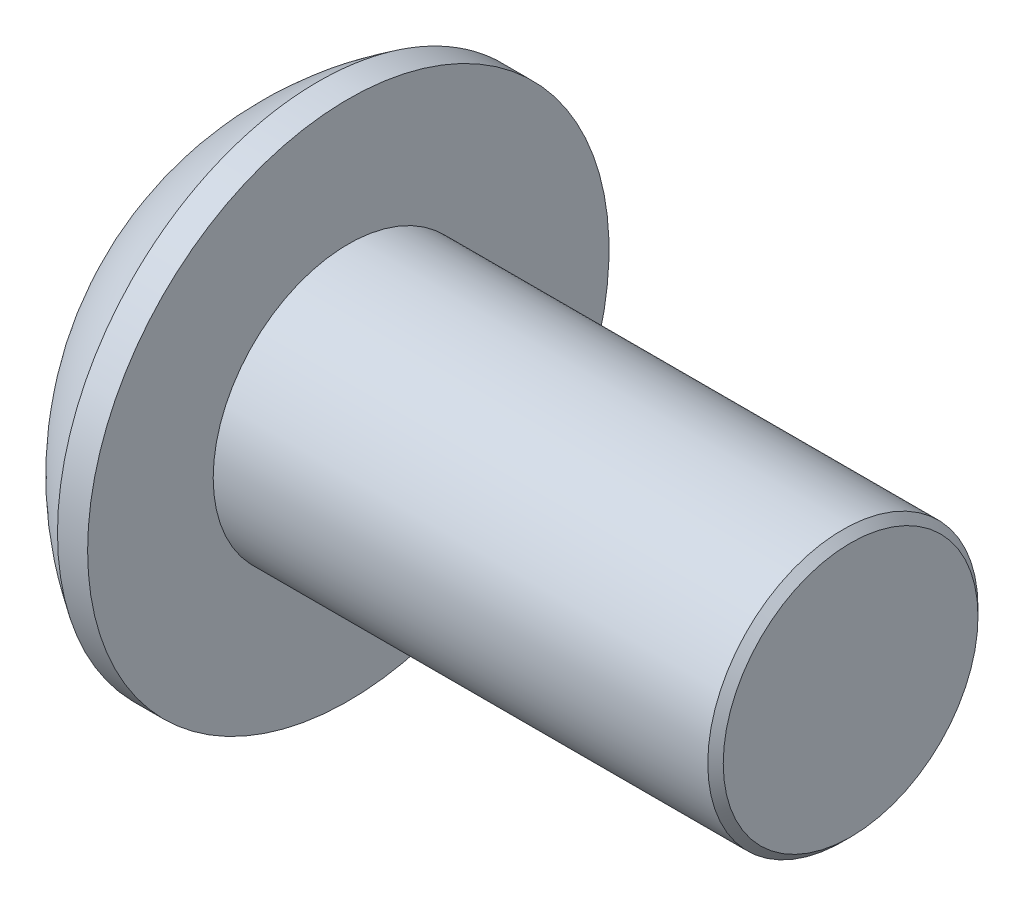
ISO-10303-21;
HEADER;
FILE_DESCRIPTION(('STEP AP214'),'2;1');
FILE_NAME('part.step','',(''),(''),'','','');
FILE_SCHEMA(('AUTOMOTIVE_DESIGN { 1 0 10303 214 1 1 1 1 }'));
ENDSEC;
DATA;
#1=APPLICATION_CONTEXT('core data for automotive mechanical design processes');
#2=APPLICATION_PROTOCOL_DEFINITION('international standard','automotive_design',2000,#1);
#3=PRODUCT_CONTEXT('',#1,'mechanical');
#4=PRODUCT('Part','Part','',(#3));
#5=PRODUCT_RELATED_PRODUCT_CATEGORY('part','',(#4));
#6=PRODUCT_DEFINITION_FORMATION('','',#4);
#7=PRODUCT_DEFINITION_CONTEXT('part definition',#1,'design');
#8=PRODUCT_DEFINITION('design','',#6,#7);
#9=PRODUCT_DEFINITION_SHAPE('','',#8);
#10=(LENGTH_UNIT() NAMED_UNIT(*) SI_UNIT(.MILLI.,.METRE.));
#11=(NAMED_UNIT(*) PLANE_ANGLE_UNIT() SI_UNIT($,.RADIAN.));
#12=(NAMED_UNIT(*) SI_UNIT($,.STERADIAN.) SOLID_ANGLE_UNIT());
#13=UNCERTAINTY_MEASURE_WITH_UNIT(LENGTH_MEASURE(1.E-05),#10,'distance_accuracy_value','');
#14=(GEOMETRIC_REPRESENTATION_CONTEXT(3) GLOBAL_UNCERTAINTY_ASSIGNED_CONTEXT((#13)) GLOBAL_UNIT_ASSIGNED_CONTEXT((#10,
#11,#12)) REPRESENTATION_CONTEXT('',''));
#15=CARTESIAN_POINT('',(0.,0.,0.));
#16=DIRECTION('',(0.,0.,1.));
#17=DIRECTION('',(1.,0.,0.));
#18=AXIS2_PLACEMENT_3D('',#15,#16,#17);
#19=CARTESIAN_POINT('',(1.32080000000034,0.,0.));
#20=DIRECTION('',(-1.,0.,0.));
#21=DIRECTION('',(0.,0.,1.));
#22=AXIS2_PLACEMENT_3D('',#19,#20,#21);
#23=CONICAL_SURFACE('',#22,1.1937999999998,1.04719755119608);
#24=CARTESIAN_POINT('',(2.01004075135902,0.,4.44089209850063E-13));
#25=VERTEX_POINT('',#24);
#26=VERTEX_LOOP('',#25);
#27=FACE_BOUND('',#26,.T.);
#28=CARTESIAN_POINT('',(1.32080000000009,0.,0.));
#29=DIRECTION('',(-1.,0.,0.));
#30=DIRECTION('',(0.,0.,1.));
#31=AXIS2_PLACEMENT_3D('',#28,#29,#30);
#32=CIRCLE('',#31,1.19380000000024);
#33=CARTESIAN_POINT('',(1.32080000000004,-1.03386112703797,0.59690000000006));
#34=VERTEX_POINT('',#33);
#35=CARTESIAN_POINT('',(1.32080000000004,0.,1.19380000000012));
#36=VERTEX_POINT('',#35);
#37=EDGE_CURVE('E19',#34,#36,#32,.T.);
#38=ORIENTED_EDGE('',*,*,#37,.T.);
#39=CARTESIAN_POINT('',(1.32080000000009,0.,0.));
#40=DIRECTION('',(-1.,0.,0.));
#41=DIRECTION('',(0.,0.,1.));
#42=AXIS2_PLACEMENT_3D('',#39,#40,#41);
#43=CIRCLE('',#42,1.19380000000024);
#44=CARTESIAN_POINT('',(1.32080000000004,1.03386112703797,0.596900000000061));
#45=VERTEX_POINT('',#44);
#46=EDGE_CURVE('E147',#36,#45,#43,.T.);
#47=ORIENTED_EDGE('',*,*,#46,.T.);
#48=CARTESIAN_POINT('',(1.32080000000009,0.,0.));
#49=DIRECTION('',(-1.,0.,0.));
#50=DIRECTION('',(0.,0.,1.));
#51=AXIS2_PLACEMENT_3D('',#48,#49,#50);
#52=CIRCLE('',#51,1.19380000000024);
#53=CARTESIAN_POINT('',(1.32080000000004,1.03386112703797,-0.596900000000061));
#54=VERTEX_POINT('',#53);
#55=EDGE_CURVE('E402',#45,#54,#52,.T.);
#56=ORIENTED_EDGE('',*,*,#55,.T.);
#57=CARTESIAN_POINT('',(1.32080000000009,0.,0.));
#58=DIRECTION('',(-1.,0.,0.));
#59=DIRECTION('',(0.,0.,1.));
#60=AXIS2_PLACEMENT_3D('',#57,#58,#59);
#61=CIRCLE('',#60,1.19380000000024);
#62=CARTESIAN_POINT('',(1.32080000000004,1.49457637585666E-12,-1.19380000000012));
#63=VERTEX_POINT('',#62);
#64=EDGE_CURVE('E403',#54,#63,#61,.T.);
#65=ORIENTED_EDGE('',*,*,#64,.T.);
#66=CARTESIAN_POINT('',(1.32080000000009,0.,0.));
#67=DIRECTION('',(-1.,0.,0.));
#68=DIRECTION('',(0.,0.,1.));
#69=AXIS2_PLACEMENT_3D('',#66,#67,#68);
#70=CIRCLE('',#69,1.19380000000024);
#71=CARTESIAN_POINT('',(1.32080000000004,-1.03386112703797,-0.59690000000006));
#72=VERTEX_POINT('',#71);
#73=EDGE_CURVE('E92',#63,#72,#70,.T.);
#74=ORIENTED_EDGE('',*,*,#73,.T.);
#75=CARTESIAN_POINT('',(1.32080000000009,0.,0.));
#76=DIRECTION('',(-1.,0.,0.));
#77=DIRECTION('',(0.,0.,1.));
#78=AXIS2_PLACEMENT_3D('',#75,#76,#77);
#79=CIRCLE('',#78,1.19380000000024);
#80=EDGE_CURVE('E88',#72,#34,#79,.T.);
#81=ORIENTED_EDGE('',*,*,#80,.T.);
#82=EDGE_LOOP('',(#38,#47,#56,#65,#74,#81));
#83=FACE_BOUND('',#82,.T.);
#84=ADVANCED_FACE('F16',(#27,#83),#23,.F.);
#85=CARTESIAN_POINT('',(1.3208,-2.06772225407572,-1.1938));
#86=DIRECTION('',(1.,0.,0.));
#87=DIRECTION('',(0.,0.,-1.));
#88=AXIS2_PLACEMENT_3D('',#85,#86,#87);
#89=PLANE('',#88);
#90=DIRECTION('',(0.,0.5,0.866025403784439));
#91=VECTOR('',#90,1.);
#92=CARTESIAN_POINT('',(1.3208,-1.37848150271715,0.));
#93=LINE('',#92,#91);
#94=CARTESIAN_POINT('',(1.3208,-0.689240751358574,1.1938));
#95=VERTEX_POINT('',#94);
#96=EDGE_CURVE('E100',#95,#34,#93,.F.);
#97=ORIENTED_EDGE('',*,*,#96,.F.);
#98=DIRECTION('',(0.,1.,0.));
#99=VECTOR('',#98,1.);
#100=CARTESIAN_POINT('',(1.3208,-0.689240751358574,1.1938));
#101=LINE('',#100,#99);
#102=EDGE_CURVE('E102',#36,#95,#101,.F.);
#103=ORIENTED_EDGE('',*,*,#102,.F.);
#104=ORIENTED_EDGE('',*,*,#37,.F.);
#105=EDGE_LOOP('',(#97,#103,#104));
#106=FACE_BOUND('',#105,.T.);
#107=ADVANCED_FACE('F98',(#106),#89,.F.);
#108=CARTESIAN_POINT('',(1.3208,-2.06772225407572,-1.1938));
#109=DIRECTION('',(1.,0.,0.));
#110=DIRECTION('',(0.,0.,-1.));
#111=AXIS2_PLACEMENT_3D('',#108,#109,#110);
#112=PLANE('',#111);
#113=DIRECTION('',(0.,-0.5,0.866025403784439));
#114=VECTOR('',#113,1.);
#115=CARTESIAN_POINT('',(1.3208,-0.689240751358574,-1.1938));
#116=LINE('',#115,#114);
#117=CARTESIAN_POINT('',(1.3208,-1.37848150271715,0.));
#118=VERTEX_POINT('',#117);
#119=EDGE_CURVE('E108',#118,#72,#116,.F.);
#120=ORIENTED_EDGE('',*,*,#119,.F.);
#121=DIRECTION('',(0.,0.5,0.866025403784439));
#122=VECTOR('',#121,1.);
#123=CARTESIAN_POINT('',(1.3208,-1.37848150271715,0.));
#124=LINE('',#123,#122);
#125=EDGE_CURVE('E105',#34,#118,#124,.F.);
#126=ORIENTED_EDGE('',*,*,#125,.F.);
#127=ORIENTED_EDGE('',*,*,#80,.F.);
#128=EDGE_LOOP('',(#120,#126,#127));
#129=FACE_BOUND('',#128,.T.);
#130=ADVANCED_FACE('F106',(#129),#112,.F.);
#131=CARTESIAN_POINT('',(1.3208,-2.06772225407572,-1.1938));
#132=DIRECTION('',(1.,0.,0.));
#133=DIRECTION('',(0.,0.,-1.));
#134=AXIS2_PLACEMENT_3D('',#131,#132,#133);
#135=PLANE('',#134);
#136=DIRECTION('',(0.,1.,0.));
#137=VECTOR('',#136,1.);
#138=CARTESIAN_POINT('',(1.3208,0.689240751358577,-1.1938));
#139=LINE('',#138,#137);
#140=CARTESIAN_POINT('',(1.3208,-0.689240751358574,-1.1938));
#141=VERTEX_POINT('',#140);
#142=EDGE_CURVE('E373',#141,#63,#139,.T.);
#143=ORIENTED_EDGE('',*,*,#142,.F.);
#144=DIRECTION('',(0.,-0.5,0.866025403784439));
#145=VECTOR('',#144,1.);
#146=CARTESIAN_POINT('',(1.3208,-0.689240751358574,-1.1938));
#147=LINE('',#146,#145);
#148=EDGE_CURVE('E385',#72,#141,#147,.F.);
#149=ORIENTED_EDGE('',*,*,#148,.F.);
#150=ORIENTED_EDGE('',*,*,#73,.F.);
#151=EDGE_LOOP('',(#143,#149,#150));
#152=FACE_BOUND('',#151,.T.);
#153=ADVANCED_FACE('F190',(#152),#135,.F.);
#154=CARTESIAN_POINT('',(1.3208,-2.06772225407572,-1.1938));
#155=DIRECTION('',(1.,0.,0.));
#156=DIRECTION('',(0.,0.,-1.));
#157=AXIS2_PLACEMENT_3D('',#154,#155,#156);
#158=PLANE('',#157);
#159=DIRECTION('',(0.,-0.5,-0.866025403784439));
#160=VECTOR('',#159,1.);
#161=CARTESIAN_POINT('',(1.3208,1.37848150271715,0.));
#162=LINE('',#161,#160);
#163=CARTESIAN_POINT('',(1.3208,0.689240751358577,-1.1938));
#164=VERTEX_POINT('',#163);
#165=EDGE_CURVE('E359',#164,#54,#162,.F.);
#166=ORIENTED_EDGE('',*,*,#165,.F.);
#167=DIRECTION('',(0.,1.,0.));
#168=VECTOR('',#167,1.);
#169=CARTESIAN_POINT('',(1.3208,0.689240751358577,-1.1938));
#170=LINE('',#169,#168);
#171=EDGE_CURVE('E370',#63,#164,#170,.T.);
#172=ORIENTED_EDGE('',*,*,#171,.F.);
#173=ORIENTED_EDGE('',*,*,#64,.F.);
#174=EDGE_LOOP('',(#166,#172,#173));
#175=FACE_BOUND('',#174,.T.);
#176=ADVANCED_FACE('F186',(#175),#158,.F.);
#177=CARTESIAN_POINT('',(1.3208,-2.06772225407572,-1.1938));
#178=DIRECTION('',(1.,0.,0.));
#179=DIRECTION('',(0.,0.,-1.));
#180=AXIS2_PLACEMENT_3D('',#177,#178,#179);
#181=PLANE('',#180);
#182=DIRECTION('',(0.,0.5,-0.866025403784439));
#183=VECTOR('',#182,1.);
#184=CARTESIAN_POINT('',(1.3208,0.689240751358576,1.1938));
#185=LINE('',#184,#183);
#186=CARTESIAN_POINT('',(1.3208,1.37848150271715,0.));
#187=VERTEX_POINT('',#186);
#188=EDGE_CURVE('E338',#187,#45,#185,.F.);
#189=ORIENTED_EDGE('',*,*,#188,.F.);
#190=DIRECTION('',(0.,-0.5,-0.866025403784439));
#191=VECTOR('',#190,1.);
#192=CARTESIAN_POINT('',(1.3208,1.37848150271715,0.));
#193=LINE('',#192,#191);
#194=EDGE_CURVE('E357',#54,#187,#193,.F.);
#195=ORIENTED_EDGE('',*,*,#194,.F.);
#196=ORIENTED_EDGE('',*,*,#55,.F.);
#197=EDGE_LOOP('',(#189,#195,#196));
#198=FACE_BOUND('',#197,.T.);
#199=ADVANCED_FACE('F182',(#198),#181,.F.);
#200=CARTESIAN_POINT('',(1.3208,-2.06772225407572,-1.1938));
#201=DIRECTION('',(1.,0.,0.));
#202=DIRECTION('',(0.,0.,-1.));
#203=AXIS2_PLACEMENT_3D('',#200,#201,#202);
#204=PLANE('',#203);
#205=DIRECTION('',(0.,1.,0.));
#206=VECTOR('',#205,1.);
#207=CARTESIAN_POINT('',(1.3208,-0.689240751358574,1.1938));
#208=LINE('',#207,#206);
#209=CARTESIAN_POINT('',(1.3208,0.689240751358576,1.1938));
#210=VERTEX_POINT('',#209);
#211=EDGE_CURVE('E117',#210,#36,#208,.F.);
#212=ORIENTED_EDGE('',*,*,#211,.F.);
#213=DIRECTION('',(0.,0.5,-0.866025403784439));
#214=VECTOR('',#213,1.);
#215=CARTESIAN_POINT('',(1.3208,0.689240751358576,1.1938));
#216=LINE('',#215,#214);
#217=EDGE_CURVE('E341',#45,#210,#216,.F.);
#218=ORIENTED_EDGE('',*,*,#217,.F.);
#219=ORIENTED_EDGE('',*,*,#46,.F.);
#220=EDGE_LOOP('',(#212,#218,#219));
#221=FACE_BOUND('',#220,.T.);
#222=ADVANCED_FACE('F178',(#221),#204,.F.);
#223=CARTESIAN_POINT('',(1.3208,-0.689240751358574,1.1938));
#224=DIRECTION('',(0.,0.,-1.));
#225=DIRECTION('',(0.,1.,0.));
#226=AXIS2_PLACEMENT_3D('',#223,#224,#225);
#227=PLANE('',#226);
#228=DIRECTION('',(0.,1.,0.));
#229=VECTOR('',#228,1.);
#230=CARTESIAN_POINT('',(0.,0.,1.1938));
#231=LINE('',#230,#229);
#232=CARTESIAN_POINT('',(0.,0.689240751358577,1.1938));
#233=VERTEX_POINT('',#232);
#234=CARTESIAN_POINT('',(0.,-0.689240751358574,1.1938));
#235=VERTEX_POINT('',#234);
#236=EDGE_CURVE('E335',#233,#235,#231,.F.);
#237=ORIENTED_EDGE('',*,*,#236,.F.);
#238=DIRECTION('',(1.,0.,0.));
#239=VECTOR('',#238,1.);
#240=CARTESIAN_POINT('',(1.3208,0.689240751358576,1.1938));
#241=LINE('',#240,#239);
#242=EDGE_CURVE('E347',#210,#233,#241,.F.);
#243=ORIENTED_EDGE('',*,*,#242,.F.);
#244=ORIENTED_EDGE('',*,*,#211,.T.);
#245=ORIENTED_EDGE('',*,*,#102,.T.);
#246=DIRECTION('',(1.,0.,0.));
#247=VECTOR('',#246,1.);
#248=CARTESIAN_POINT('',(1.3208,-0.689240751358574,1.1938));
#249=LINE('',#248,#247);
#250=EDGE_CURVE('E111',#235,#95,#249,.T.);
#251=ORIENTED_EDGE('',*,*,#250,.F.);
#252=EDGE_LOOP('',(#237,#243,#244,#245,#251));
#253=FACE_BOUND('',#252,.T.);
#254=ADVANCED_FACE('F175',(#253),#227,.T.);
#255=CARTESIAN_POINT('',(1.3208,-1.37848150271715,0.));
#256=DIRECTION('',(0.,0.866025403784439,-0.5));
#257=DIRECTION('',(0.,0.5,0.866025403784439));
#258=AXIS2_PLACEMENT_3D('',#255,#256,#257);
#259=PLANE('',#258);
#260=DIRECTION('',(0.,-0.5,-0.866025403784439));
#261=VECTOR('',#260,1.);
#262=CARTESIAN_POINT('',(0.,-0.689240751358574,1.1938));
#263=LINE('',#262,#261);
#264=CARTESIAN_POINT('',(0.,-1.37848150271715,0.));
#265=VERTEX_POINT('',#264);
#266=EDGE_CURVE('E332',#235,#265,#263,.T.);
#267=ORIENTED_EDGE('',*,*,#266,.F.);
#268=ORIENTED_EDGE('',*,*,#250,.T.);
#269=ORIENTED_EDGE('',*,*,#96,.T.);
#270=ORIENTED_EDGE('',*,*,#125,.T.);
#271=DIRECTION('',(1.,0.,0.));
#272=VECTOR('',#271,1.);
#273=CARTESIAN_POINT('',(1.3208,-1.37848150271715,0.));
#274=LINE('',#273,#272);
#275=EDGE_CURVE('E382',#265,#118,#274,.T.);
#276=ORIENTED_EDGE('',*,*,#275,.F.);
#277=EDGE_LOOP('',(#267,#268,#269,#270,#276));
#278=FACE_BOUND('',#277,.T.);
#279=ADVANCED_FACE('F115',(#278),#259,.T.);
#280=CARTESIAN_POINT('',(1.3208,-0.689240751358574,-1.1938));
#281=DIRECTION('',(0.,0.866025403784439,0.5));
#282=DIRECTION('',(0.,-0.5,0.866025403784439));
#283=AXIS2_PLACEMENT_3D('',#280,#281,#282);
#284=PLANE('',#283);
#285=DIRECTION('',(0.,0.5,-0.866025403784439));
#286=VECTOR('',#285,1.);
#287=CARTESIAN_POINT('',(0.,-1.37848150271715,0.));
#288=LINE('',#287,#286);
#289=CARTESIAN_POINT('',(0.,-0.689240751358574,-1.1938));
#290=VERTEX_POINT('',#289);
#291=EDGE_CURVE('E329',#265,#290,#288,.T.);
#292=ORIENTED_EDGE('',*,*,#291,.F.);
#293=ORIENTED_EDGE('',*,*,#275,.T.);
#294=ORIENTED_EDGE('',*,*,#119,.T.);
#295=ORIENTED_EDGE('',*,*,#148,.T.);
#296=DIRECTION('',(1.,0.,0.));
#297=VECTOR('',#296,1.);
#298=CARTESIAN_POINT('',(1.3208,-0.689240751358574,-1.1938));
#299=LINE('',#298,#297);
#300=EDGE_CURVE('E367',#290,#141,#299,.T.);
#301=ORIENTED_EDGE('',*,*,#300,.F.);
#302=EDGE_LOOP('',(#292,#293,#294,#295,#301));
#303=FACE_BOUND('',#302,.T.);
#304=ADVANCED_FACE('F168',(#303),#284,.T.);
#305=CARTESIAN_POINT('',(1.3208,0.689240751358577,-1.1938));
#306=DIRECTION('',(0.,0.,1.));
#307=DIRECTION('',(1.,0.,0.));
#308=AXIS2_PLACEMENT_3D('',#305,#306,#307);
#309=PLANE('',#308);
#310=DIRECTION('',(0.,1.,0.));
#311=VECTOR('',#310,1.);
#312=CARTESIAN_POINT('',(0.,0.,-1.1938));
#313=LINE('',#312,#311);
#314=CARTESIAN_POINT('',(0.,0.689240751358577,-1.1938));
#315=VERTEX_POINT('',#314);
#316=EDGE_CURVE('E326',#290,#315,#313,.T.);
#317=ORIENTED_EDGE('',*,*,#316,.F.);
#318=ORIENTED_EDGE('',*,*,#300,.T.);
#319=ORIENTED_EDGE('',*,*,#142,.T.);
#320=ORIENTED_EDGE('',*,*,#171,.T.);
#321=DIRECTION('',(1.,0.,0.));
#322=VECTOR('',#321,1.);
#323=CARTESIAN_POINT('',(1.3208,0.689240751358577,-1.1938));
#324=LINE('',#323,#322);
#325=EDGE_CURVE('E342',#315,#164,#324,.T.);
#326=ORIENTED_EDGE('',*,*,#325,.F.);
#327=EDGE_LOOP('',(#317,#318,#319,#320,#326));
#328=FACE_BOUND('',#327,.T.);
#329=ADVANCED_FACE('F165',(#328),#309,.T.);
#330=CARTESIAN_POINT('',(1.3208,1.37848150271715,0.));
#331=DIRECTION('',(0.,-0.866025403784439,0.5));
#332=DIRECTION('',(0.,-0.5,-0.866025403784439));
#333=AXIS2_PLACEMENT_3D('',#330,#331,#332);
#334=PLANE('',#333);
#335=DIRECTION('',(0.,0.5,0.866025403784439));
#336=VECTOR('',#335,1.);
#337=CARTESIAN_POINT('',(0.,0.689240751358577,-1.1938));
#338=LINE('',#337,#336);
#339=CARTESIAN_POINT('',(0.,1.37848150271715,0.));
#340=VERTEX_POINT('',#339);
#341=EDGE_CURVE('E323',#315,#340,#338,.T.);
#342=ORIENTED_EDGE('',*,*,#341,.F.);
#343=ORIENTED_EDGE('',*,*,#325,.T.);
#344=ORIENTED_EDGE('',*,*,#165,.T.);
#345=ORIENTED_EDGE('',*,*,#194,.T.);
#346=DIRECTION('',(1.,0.,0.));
#347=VECTOR('',#346,1.);
#348=CARTESIAN_POINT('',(1.3208,1.37848150271715,0.));
#349=LINE('',#348,#347);
#350=EDGE_CURVE('E34',#340,#187,#349,.T.);
#351=ORIENTED_EDGE('',*,*,#350,.F.);
#352=EDGE_LOOP('',(#342,#343,#344,#345,#351));
#353=FACE_BOUND('',#352,.T.);
#354=ADVANCED_FACE('F161',(#353),#334,.T.);
#355=CARTESIAN_POINT('',(1.3208,0.689240751358576,1.1938));
#356=DIRECTION('',(0.,-0.866025403784439,-0.5));
#357=DIRECTION('',(0.,0.5,-0.866025403784439));
#358=AXIS2_PLACEMENT_3D('',#355,#356,#357);
#359=PLANE('',#358);
#360=DIRECTION('',(0.,-0.5,0.866025403784439));
#361=VECTOR('',#360,1.);
#362=CARTESIAN_POINT('',(0.,1.37848150271715,0.));
#363=LINE('',#362,#361);
#364=EDGE_CURVE('E146',#340,#233,#363,.T.);
#365=ORIENTED_EDGE('',*,*,#364,.F.);
#366=ORIENTED_EDGE('',*,*,#350,.T.);
#367=ORIENTED_EDGE('',*,*,#188,.T.);
#368=ORIENTED_EDGE('',*,*,#217,.T.);
#369=ORIENTED_EDGE('',*,*,#242,.T.);
#370=EDGE_LOOP('',(#365,#366,#367,#368,#369));
#371=FACE_BOUND('',#370,.T.);
#372=ADVANCED_FACE('F157',(#371),#359,.T.);
#373=CARTESIAN_POINT('',(0.,0.,0.));
#374=DIRECTION('',(-1.,0.,0.));
#375=DIRECTION('',(0.,0.,1.));
#376=AXIS2_PLACEMENT_3D('',#373,#374,#375);
#377=PLANE('',#376);
#378=ORIENTED_EDGE('',*,*,#341,.T.);
#379=ORIENTED_EDGE('',*,*,#364,.T.);
#380=ORIENTED_EDGE('',*,*,#236,.T.);
#381=ORIENTED_EDGE('',*,*,#266,.T.);
#382=ORIENTED_EDGE('',*,*,#291,.T.);
#383=ORIENTED_EDGE('',*,*,#316,.T.);
#384=EDGE_LOOP('',(#378,#379,#380,#381,#382,#383));
#385=FACE_BOUND('',#384,.T.);
#386=CARTESIAN_POINT('',(0.,1.647825,0.));
#387=CARTESIAN_POINT('',(1.63319194702151E-13,1.64781976319874,0.092490203977753));
#388=CARTESIAN_POINT('',(1.32890083579297E-13,1.63999511633709,0.18514501432637));
#389=CARTESIAN_POINT('',(0.,1.6167119250047,0.322075808080013));
#390=CARTESIAN_POINT('',(-1.58500729597375E-13,1.60700618770234,0.36743553339636));
#391=CARTESIAN_POINT('',(1.59063479291743E-13,1.58380101865853,0.45722093569514));
#392=CARTESIAN_POINT('',(5.6924253476393E-13,1.5702985083103,0.501645823115263));
#393=CARTESIAN_POINT('',(9.37393023603841E-13,1.52428156574313,0.632817459278967));
#394=CARTESIAN_POINT('',(0.,1.48621992666366,0.717681965518643));
#395=CARTESIAN_POINT('',(0.,1.39637079695658,0.879809706624016));
#396=CARTESIAN_POINT('',(7.82184274151218E-13,1.34458278455109,0.957072652379995));
#397=CARTESIAN_POINT('',(4.86982737501784E-13,1.25777784714521,1.06558770210237));
#398=CARTESIAN_POINT('',(1.33453761487452E-13,1.22729946114794,1.10054993332365));
#399=CARTESIAN_POINT('',(-1.3289162015903E-13,1.16354004969106,1.16775237388221));
#400=CARTESIAN_POINT('',(0.,1.13026175473033,1.19999517515816));
#401=CARTESIAN_POINT('',(0.,1.02649304340867,1.29236218866442));
#402=CARTESIAN_POINT('',(0.,0.952049986714077,1.34814848277712));
#403=CARTESIAN_POINT('',(0.,0.794895196754067,1.44639825105765));
#404=CARTESIAN_POINT('',(0.,0.712183775431296,1.48886222758992));
#405=CARTESIAN_POINT('',(0.,0.540796624265731,1.55930919813143));
#406=CARTESIAN_POINT('',(0.,0.452120958135287,1.58729234680268));
#407=CARTESIAN_POINT('',(0.,0.271332331080319,1.62797191307413));
#408=CARTESIAN_POINT('',(0.,0.179219351801791,1.64066824903626));
#409=CARTESIAN_POINT('',(0.,-0.0058307702784061,1.65041748705408));
#410=CARTESIAN_POINT('',(0.,-0.0987679130800752,1.64747038910978));
#411=CARTESIAN_POINT('',(0.,-0.282830196388822,1.62601274134435));
#412=CARTESIAN_POINT('',(0.,-0.373955346570016,1.60750227463794));
#413=CARTESIAN_POINT('',(0.,-0.551796068178801,1.55545413364523));
#414=CARTESIAN_POINT('',(0.,-0.638511592498163,1.52191629885843));
#415=CARTESIAN_POINT('',(0.,-0.805120175533149,1.44072378052346));
#416=CARTESIAN_POINT('',(0.,-0.885012976819951,1.39306856461393));
#417=CARTESIAN_POINT('',(0.,-0.997912879588355,1.31211658756413));
#418=CARTESIAN_POINT('',(0.,-1.0343949246834,1.28354906167734));
#419=CARTESIAN_POINT('',(0.,-1.10486279842068,1.22341829303709));
#420=CARTESIAN_POINT('',(0.,-1.13884618403291,1.19185218578117));
#421=CARTESIAN_POINT('',(0.,-1.23657300939908,1.09305906467359));
#422=CARTESIAN_POINT('',(0.,-1.29619288399356,1.02166556658612));
#423=CARTESIAN_POINT('',(0.,-1.40258050817755,0.869876423478031));
#424=CARTESIAN_POINT('',(0.,-1.44934874627766,0.789481120793477));
#425=CARTESIAN_POINT('',(0.,-1.50889406070375,0.66387095931334));
#426=CARTESIAN_POINT('',(0.,-1.52698985473586,0.621110806760426));
#427=CARTESIAN_POINT('',(0.,-1.55950093966664,0.53426077686433));
#428=CARTESIAN_POINT('',(-1.05235362596779E-13,-1.57391920916438,0.490172008203167));
#429=CARTESIAN_POINT('',(2.10568324685354E-13,-1.61146177909579,0.356445777718595));
#430=CARTESIAN_POINT('',(1.14396658334039E-12,-1.62897899568074,0.265126085962904));
#431=CARTESIAN_POINT('',(4.347347107204E-13,-1.64174347214908,0.144386595969386));
#432=CARTESIAN_POINT('',(1.21682740895759E-13,-1.64402207668915,0.115560405797873));
#433=CARTESIAN_POINT('',(-1.21249060026839E-13,-1.6470636594012,0.0578281757252688));
#434=CARTESIAN_POINT('',(0.,-1.64782663757318,0.0289221358241775));
#435=CARTESIAN_POINT('',(1.63505268006993E-13,-1.64781976319874,-0.0924902039777536));
#436=CARTESIAN_POINT('',(1.32794566155401E-13,-1.63999511633709,-0.18514501432637));
#437=CARTESIAN_POINT('',(0.,-1.6167119250047,-0.322075808080014));
#438=CARTESIAN_POINT('',(-1.58310187784522E-13,-1.60700618770234,-0.367435533396361));
#439=CARTESIAN_POINT('',(1.58872782530651E-13,-1.58380101865853,-0.45722093569514));
#440=CARTESIAN_POINT('',(5.68527399730162E-13,-1.5702985083103,-0.501645823115263));
#441=CARTESIAN_POINT('',(9.36221934104128E-13,-1.52428156574313,-0.632817459278966));
#442=CARTESIAN_POINT('',(0.,-1.48621992666366,-0.717681965518643));
#443=CARTESIAN_POINT('',(0.,-1.39637079695658,-0.879809706624015));
#444=CARTESIAN_POINT('',(7.809853327574E-13,-1.34458278455109,-0.957072652379992));
#445=CARTESIAN_POINT('',(4.86281382838322E-13,-1.25777784714521,-1.06558770210237));
#446=CARTESIAN_POINT('',(1.33300307899813E-13,-1.22729946114794,-1.10054993332365));
#447=CARTESIAN_POINT('',(-1.32738314523763E-13,-1.16354004969107,-1.16775237388221));
#448=CARTESIAN_POINT('',(0.,-1.13026175473033,-1.19999517515816));
#449=CARTESIAN_POINT('',(0.,-1.02649304340867,-1.29236218866442));
#450=CARTESIAN_POINT('',(0.,-0.952049986714081,-1.34814848277713));
#451=CARTESIAN_POINT('',(0.,-0.794895196754072,-1.44639825105765));
#452=CARTESIAN_POINT('',(0.,-0.7121837754313,-1.48886222758991));
#453=CARTESIAN_POINT('',(0.,-0.540796624265734,-1.55930919813143));
#454=CARTESIAN_POINT('',(0.,-0.452120958135291,-1.58729234680268));
#455=CARTESIAN_POINT('',(0.,-0.271332331080322,-1.62797191307413));
#456=CARTESIAN_POINT('',(0.,-0.179219351801793,-1.64066824903626));
#457=CARTESIAN_POINT('',(0.,0.00583077027840386,-1.65041748705408));
#458=CARTESIAN_POINT('',(0.,0.0987679130800731,-1.64747038910978));
#459=CARTESIAN_POINT('',(0.,0.28283019638882,-1.62601274134436));
#460=CARTESIAN_POINT('',(0.,0.373955346570014,-1.60750227463794));
#461=CARTESIAN_POINT('',(0.,0.551796068178799,-1.55545413364523));
#462=CARTESIAN_POINT('',(0.,0.638511592498161,-1.52191629885844));
#463=CARTESIAN_POINT('',(0.,0.805120175533147,-1.44072378052347));
#464=CARTESIAN_POINT('',(0.,0.885012976819949,-1.39306856461393));
#465=CARTESIAN_POINT('',(0.,0.997912879588353,-1.31211658756413));
#466=CARTESIAN_POINT('',(0.,1.03439492468339,-1.28354906167734));
#467=CARTESIAN_POINT('',(0.,1.10486279842068,-1.22341829303709));
#468=CARTESIAN_POINT('',(0.,1.1388461840329,-1.19185218578117));
#469=CARTESIAN_POINT('',(0.,1.23657300939908,-1.09305906467358));
#470=CARTESIAN_POINT('',(0.,1.29619288399356,-1.02166556658612));
#471=CARTESIAN_POINT('',(0.,1.40258050817755,-0.869876423478032));
#472=CARTESIAN_POINT('',(0.,1.44934874627765,-0.789481120793476));
#473=CARTESIAN_POINT('',(0.,1.50889406070375,-0.66387095931334));
#474=CARTESIAN_POINT('',(0.,1.52698985473586,-0.621110806760427));
#475=CARTESIAN_POINT('',(0.,1.55950093966664,-0.534260776864331));
#476=CARTESIAN_POINT('',(-1.05163336027755E-13,1.57391920916437,-0.490172008203168));
#477=CARTESIAN_POINT('',(2.10424649207135E-13,1.61146177909579,-0.356445777718595));
#478=CARTESIAN_POINT('',(1.1439193518672E-12,1.62897899568074,-0.265126085962905));
#479=CARTESIAN_POINT('',(4.34749480231378E-13,1.64174347214908,-0.144386595969387));
#480=CARTESIAN_POINT('',(1.21707467703441E-13,1.64402207668915,-0.115560405797874));
#481=CARTESIAN_POINT('',(-1.21273786834522E-13,1.6470636594012,-0.0578281757252697));
#482=CARTESIAN_POINT('',(0.,1.64782663757318,-0.0289221358241784));
#483=CARTESIAN_POINT('',(0.,1.647825,0.));
#484=B_SPLINE_CURVE_WITH_KNOTS('',3,(#386,#387,#388,#389,#390,#391,#392,#393,#394,#395,#396,
#397,#398,#399,#400,#401,#402,#403,#404,#405,#406,#407,#408,#409,#410,#411,#412,#413,#414,#415,
#416,#417,#418,#419,#420,#421,#422,#423,#424,#425,#426,#427,#428,#429,#430,#431,#432,#433,#434,
#435,#436,#437,#438,#439,#440,#441,#442,#443,#444,#445,#446,#447,#448,#449,#450,#451,#452,#453,
#454,#455,#456,#457,#458,#459,#460,#461,#462,#463,#464,#465,#466,#467,#468,#469,#470,#471,#472,
#473,#474,#475,#476,#477,#478,#479,#480,#481,#482,#483),.UNSPECIFIED.,.T.,.F.,(4,2,2,2,2,2,2,2,
2,2,2,2,2,2,2,2,2,2,2,2,2,2,2,2,2,2,2,2,2,2,2,2,2,2,2,2,2,2,2,2,2,2,2,2,2,2,2,2,4),(0.,
0.277336029422426,0.416368541537111,0.5555141146256,0.833141970294986,1.11078038089036,
1.24978149120748,1.38864858351854,1.66629367015056,1.94392828594775,2.22155993641642,
2.49919306954937,2.77682620268234,3.05445785315101,3.3320924689482,3.6097375555799,
3.74860464789074,3.88760575820767,4.16524416880332,4.44287202447287,4.5820175975616,
4.72105010967662,4.99838613909882,5.08511046196677,5.17183478483476,5.44917081425719,
5.58820332637187,5.72734889946036,6.00497675512975,6.28261516572512,6.42161627604224,
6.5604833683533,6.83812845498532,7.11576307078251,7.39339472125118,7.67102785438413,
7.9486609875171,8.22629263798578,8.50392725378296,8.78157234041466,8.9204394327255,
9.05944054304243,9.33707895363808,9.61470680930763,9.75385238239637,9.89288489451138,
10.1702209239336,10.2569452468015,10.3436695696695),.UNSPECIFIED.);
#485=CARTESIAN_POINT('',(0.,1.647825,0.));
#486=VERTEX_POINT('',#485);
#487=EDGE_CURVE('E139',#486,#486,#484,.T.);
#488=ORIENTED_EDGE('',*,*,#487,.F.);
#489=EDGE_LOOP('',(#488));
#490=FACE_BOUND('',#489,.T.);
#491=ADVANCED_FACE('F153',(#385,#490),#377,.T.);
#492=CARTESIAN_POINT('',(3.50132362607759,0.,0.));
#493=DIRECTION('',(0.,1.,0.));
#494=DIRECTION('',(1.,0.,0.));
#495=AXIS2_PLACEMENT_3D('',#492,#493,#494);
#496=SPHERICAL_SURFACE('',#495,3.86970210289553);
#497=CARTESIAN_POINT('',(1.4732,0.,0.));
#498=DIRECTION('',(-1.,0.,0.));
#499=DIRECTION('',(0.,0.,1.));
#500=AXIS2_PLACEMENT_3D('',#497,#498,#499);
#501=CIRCLE('',#500,3.29565);
#502=CARTESIAN_POINT('',(1.4732,0.,3.29565));
#503=VERTEX_POINT('',#502);
#504=EDGE_CURVE('E136',#503,#503,#501,.F.);
#505=ORIENTED_EDGE('',*,*,#504,.F.);
#506=EDGE_LOOP('',(#505));
#507=FACE_BOUND('',#506,.T.);
#508=ORIENTED_EDGE('',*,*,#487,.T.);
#509=EDGE_LOOP('',(#508));
#510=FACE_BOUND('',#509,.T.);
#511=ADVANCED_FACE('F149',(#507,#510),#496,.T.);
#512=CARTESIAN_POINT('',(8.2042,0.,0.));
#513=DIRECTION('',(-1.,0.,0.));
#514=DIRECTION('',(0.,0.,1.));
#515=AXIS2_PLACEMENT_3D('',#512,#513,#514);
#516=PLANE('',#515);
#517=CARTESIAN_POINT('',(8.20419999996602,0.,0.));
#518=DIRECTION('',(-1.,0.,0.));
#519=DIRECTION('',(0.,0.,1.));
#520=AXIS2_PLACEMENT_3D('',#517,#518,#519);
#521=CIRCLE('',#520,1.61036000002923);
#522=CARTESIAN_POINT('',(8.20419999996602,0.,1.61036000002923));
#523=VERTEX_POINT('',#522);
#524=EDGE_CURVE('E133',#523,#523,#521,.T.);
#525=ORIENTED_EDGE('',*,*,#524,.F.);
#526=EDGE_LOOP('',(#525));
#527=FACE_BOUND('',#526,.T.);
#528=ADVANCED_FACE('F220',(#527),#516,.F.);
#529=CARTESIAN_POINT('',(0.,0.,0.));
#530=DIRECTION('',(-1.,0.,0.));
#531=DIRECTION('',(0.,0.,1.));
#532=AXIS2_PLACEMENT_3D('',#529,#530,#531);
#533=CYLINDRICAL_SURFACE('',#532,3.29565);
#534=ORIENTED_EDGE('',*,*,#504,.T.);
#535=EDGE_LOOP('',(#534));
#536=FACE_BOUND('',#535,.T.);
#537=CARTESIAN_POINT('',(1.8542,0.,0.));
#538=DIRECTION('',(-1.,0.,0.));
#539=DIRECTION('',(0.,0.,1.));
#540=AXIS2_PLACEMENT_3D('',#537,#538,#539);
#541=CIRCLE('',#540,3.29565);
#542=CARTESIAN_POINT('',(1.8542,0.,3.29565));
#543=VERTEX_POINT('',#542);
#544=EDGE_CURVE('E130',#543,#543,#541,.T.);
#545=ORIENTED_EDGE('',*,*,#544,.T.);
#546=EDGE_LOOP('',(#545));
#547=FACE_BOUND('',#546,.T.);
#548=ADVANCED_FACE('F217',(#536,#547),#533,.T.);
#549=CARTESIAN_POINT('',(8.10640999998213,0.,0.));
#550=DIRECTION('',(-1.,0.,0.));
#551=DIRECTION('',(0.,0.,1.));
#552=AXIS2_PLACEMENT_3D('',#549,#550,#551);
#553=CONICAL_SURFACE('',#552,1.70814999995628,0.785398163106808);
#554=CARTESIAN_POINT('',(8.10641,0.,0.));
#555=DIRECTION('',(-1.,0.,0.));
#556=DIRECTION('',(0.,0.,1.));
#557=AXIS2_PLACEMENT_3D('',#554,#555,#556);
#558=CIRCLE('',#557,1.70815);
#559=CARTESIAN_POINT('',(8.10641,0.,1.70815));
#560=VERTEX_POINT('',#559);
#561=EDGE_CURVE('E25',#560,#560,#558,.T.);
#562=ORIENTED_EDGE('',*,*,#561,.F.);
#563=EDGE_LOOP('',(#562));
#564=FACE_BOUND('',#563,.T.);
#565=ORIENTED_EDGE('',*,*,#524,.T.);
#566=EDGE_LOOP('',(#565));
#567=FACE_BOUND('',#566,.T.);
#568=ADVANCED_FACE('F210',(#564,#567),#553,.T.);
#569=CARTESIAN_POINT('',(1.8542,1.70815,0.));
#570=DIRECTION('',(-1.,0.,0.));
#571=DIRECTION('',(0.,0.,1.));
#572=AXIS2_PLACEMENT_3D('',#569,#570,#571);
#573=PLANE('',#572);
#574=CARTESIAN_POINT('',(1.8542,0.,0.));
#575=DIRECTION('',(-1.,0.,0.));
#576=DIRECTION('',(0.,0.,1.));
#577=AXIS2_PLACEMENT_3D('',#574,#575,#576);
#578=CIRCLE('',#577,1.70815);
#579=CARTESIAN_POINT('',(1.8542,0.,1.70815));
#580=VERTEX_POINT('',#579);
#581=EDGE_CURVE('E10',#580,#580,#578,.F.);
#582=ORIENTED_EDGE('',*,*,#581,.F.);
#583=EDGE_LOOP('',(#582));
#584=FACE_BOUND('',#583,.T.);
#585=ORIENTED_EDGE('',*,*,#544,.F.);
#586=EDGE_LOOP('',(#585));
#587=FACE_BOUND('',#586,.T.);
#588=ADVANCED_FACE('F204',(#584,#587),#573,.F.);
#589=CARTESIAN_POINT('',(0.,0.,0.));
#590=DIRECTION('',(-1.,0.,0.));
#591=DIRECTION('',(0.,0.,1.));
#592=AXIS2_PLACEMENT_3D('',#589,#590,#591);
#593=CYLINDRICAL_SURFACE('',#592,1.70815);
#594=ORIENTED_EDGE('',*,*,#581,.T.);
#595=EDGE_LOOP('',(#594));
#596=FACE_BOUND('',#595,.T.);
#597=ORIENTED_EDGE('',*,*,#561,.T.);
#598=EDGE_LOOP('',(#597));
#599=FACE_BOUND('',#598,.T.);
#600=ADVANCED_FACE('F202',(#596,#599),#593,.T.);
#601=CLOSED_SHELL('',(#84,#107,#130,#153,#176,#199,#222,#254,#279,#304,#329,#354,#372,#491,#511,
#528,#548,#568,#588,#600));
#602=MANIFOLD_SOLID_BREP('B1',#601);
#603=ADVANCED_BREP_SHAPE_REPRESENTATION('',(#18,#602),#14);
#604=SHAPE_DEFINITION_REPRESENTATION(#9,#603);
ENDSEC;
END-ISO-10303-21;
